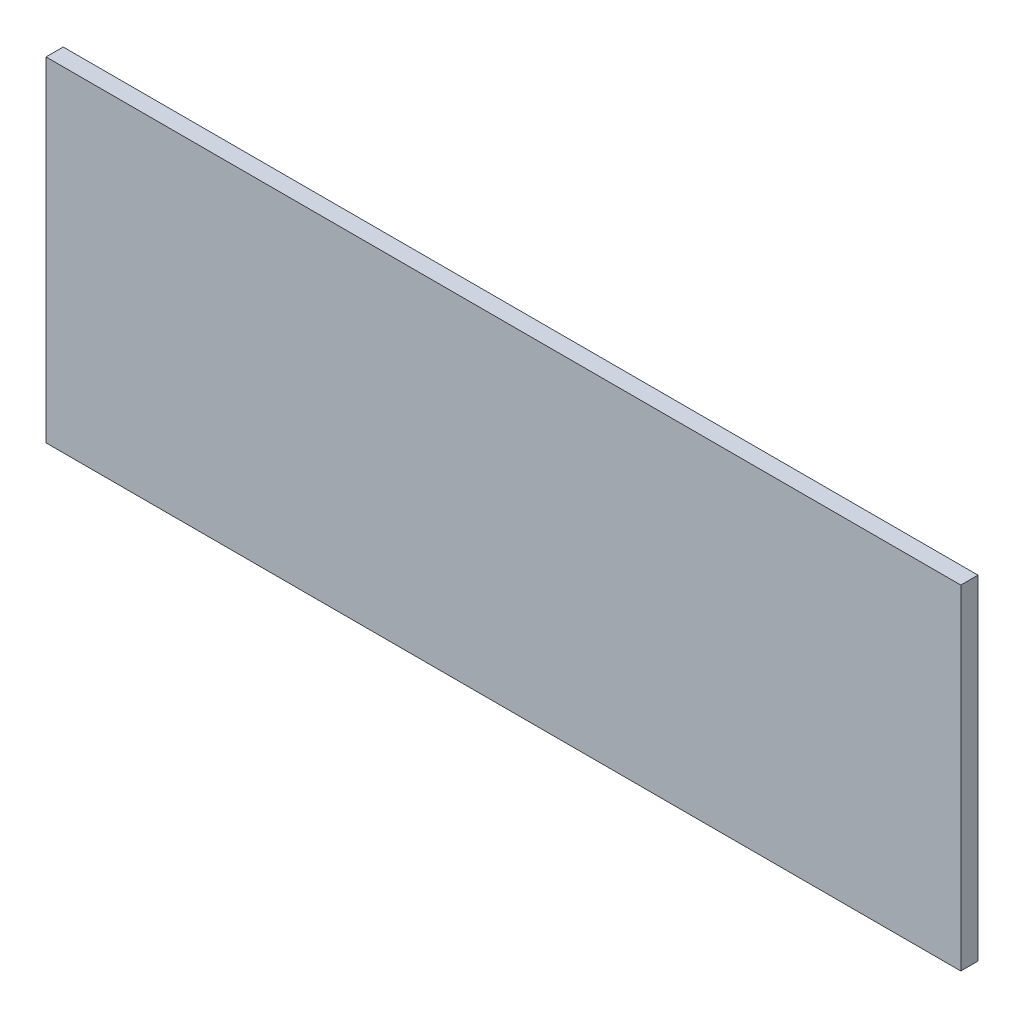
ISO-10303-21;
HEADER;
FILE_DESCRIPTION(('STEP AP214'),'2;1');
FILE_NAME('part.step','',(''),(''),'','','');
FILE_SCHEMA(('AUTOMOTIVE_DESIGN { 1 0 10303 214 1 1 1 1 }'));
ENDSEC;
DATA;
#1=APPLICATION_CONTEXT('core data for automotive mechanical design processes');
#2=APPLICATION_PROTOCOL_DEFINITION('international standard','automotive_design',2000,#1);
#3=PRODUCT_CONTEXT('',#1,'mechanical');
#4=PRODUCT('Part','Part','',(#3));
#5=PRODUCT_RELATED_PRODUCT_CATEGORY('part','',(#4));
#6=PRODUCT_DEFINITION_FORMATION('','',#4);
#7=PRODUCT_DEFINITION_CONTEXT('part definition',#1,'design');
#8=PRODUCT_DEFINITION('design','',#6,#7);
#9=PRODUCT_DEFINITION_SHAPE('','',#8);
#10=(LENGTH_UNIT() NAMED_UNIT(*) SI_UNIT(.MILLI.,.METRE.));
#11=(NAMED_UNIT(*) PLANE_ANGLE_UNIT() SI_UNIT($,.RADIAN.));
#12=(NAMED_UNIT(*) SI_UNIT($,.STERADIAN.) SOLID_ANGLE_UNIT());
#13=UNCERTAINTY_MEASURE_WITH_UNIT(LENGTH_MEASURE(1.E-05),#10,'distance_accuracy_value','');
#14=(GEOMETRIC_REPRESENTATION_CONTEXT(3) GLOBAL_UNCERTAINTY_ASSIGNED_CONTEXT((#13)) GLOBAL_UNIT_ASSIGNED_CONTEXT((#10,
#11,#12)) REPRESENTATION_CONTEXT('',''));
#15=CARTESIAN_POINT('',(0.,0.,0.));
#16=DIRECTION('',(0.,0.,1.));
#17=DIRECTION('',(1.,0.,0.));
#18=AXIS2_PLACEMENT_3D('',#15,#16,#17);
#19=CARTESIAN_POINT('',(0.,0.,5.));
#20=DIRECTION('',(1.,0.,0.));
#21=DIRECTION('',(0.,1.,0.));
#22=AXIS2_PLACEMENT_3D('',#19,#20,#21);
#23=PLANE('',#22);
#24=DIRECTION('',(0.,-1.,0.));
#25=VECTOR('',#24,1.);
#26=CARTESIAN_POINT('',(0.,0.,0.));
#27=LINE('',#26,#25);
#28=CARTESIAN_POINT('',(0.,0.,0.));
#29=VERTEX_POINT('',#28);
#30=CARTESIAN_POINT('',(1.11022302462516E-13,-97.1922331472609,0.));
#31=VERTEX_POINT('',#30);
#32=EDGE_CURVE('E96',#29,#31,#27,.T.);
#33=ORIENTED_EDGE('',*,*,#32,.T.);
#34=DIRECTION('',(0.,0.,-1.));
#35=VECTOR('',#34,1.);
#36=CARTESIAN_POINT('',(1.11022302462516E-13,-97.1922331472609,5.));
#37=LINE('',#36,#35);
#38=CARTESIAN_POINT('',(1.11022302462516E-13,-97.1922331472609,5.));
#39=VERTEX_POINT('',#38);
#40=EDGE_CURVE('E11',#39,#31,#37,.T.);
#41=ORIENTED_EDGE('',*,*,#40,.F.);
#42=DIRECTION('',(0.,-1.,0.));
#43=VECTOR('',#42,1.);
#44=CARTESIAN_POINT('',(0.,0.,5.));
#45=LINE('',#44,#43);
#46=CARTESIAN_POINT('',(0.,0.,5.));
#47=VERTEX_POINT('',#46);
#48=EDGE_CURVE('E84',#47,#39,#45,.T.);
#49=ORIENTED_EDGE('',*,*,#48,.F.);
#50=DIRECTION('',(0.,0.,-1.));
#51=VECTOR('',#50,1.);
#52=CARTESIAN_POINT('',(0.,0.,5.));
#53=LINE('',#52,#51);
#54=EDGE_CURVE('E92',#47,#29,#53,.T.);
#55=ORIENTED_EDGE('',*,*,#54,.T.);
#56=EDGE_LOOP('',(#33,#41,#49,#55));
#57=FACE_BOUND('',#56,.T.);
#58=ADVANCED_FACE('F33',(#57),#23,.F.);
#59=CARTESIAN_POINT('',(1.11022302462516E-13,-97.1922331472609,5.));
#60=DIRECTION('',(0.,1.,0.));
#61=DIRECTION('',(-1.,0.,0.));
#62=AXIS2_PLACEMENT_3D('',#59,#60,#61);
#63=PLANE('',#62);
#64=DIRECTION('',(1.,0.,0.));
#65=VECTOR('',#64,1.);
#66=CARTESIAN_POINT('',(1.11022302462516E-13,-97.1922331472609,0.));
#67=LINE('',#66,#65);
#68=CARTESIAN_POINT('',(266.,-97.1922331472609,0.));
#69=VERTEX_POINT('',#68);
#70=EDGE_CURVE('E88',#31,#69,#67,.T.);
#71=ORIENTED_EDGE('',*,*,#70,.T.);
#72=DIRECTION('',(0.,0.,-1.));
#73=VECTOR('',#72,1.);
#74=CARTESIAN_POINT('',(266.,-97.1922331472609,5.));
#75=LINE('',#74,#73);
#76=CARTESIAN_POINT('',(266.,-97.1922331472609,5.));
#77=VERTEX_POINT('',#76);
#78=EDGE_CURVE('E41',#77,#69,#75,.T.);
#79=ORIENTED_EDGE('',*,*,#78,.F.);
#80=DIRECTION('',(1.,0.,0.));
#81=VECTOR('',#80,1.);
#82=CARTESIAN_POINT('',(1.11022302462516E-13,-97.1922331472609,5.));
#83=LINE('',#82,#81);
#84=EDGE_CURVE('E79',#39,#77,#83,.T.);
#85=ORIENTED_EDGE('',*,*,#84,.F.);
#86=ORIENTED_EDGE('',*,*,#40,.T.);
#87=EDGE_LOOP('',(#71,#79,#85,#86));
#88=FACE_BOUND('',#87,.T.);
#89=ADVANCED_FACE('F87',(#88),#63,.F.);
#90=CARTESIAN_POINT('',(266.,0.,5.));
#91=DIRECTION('',(-1.,0.,0.));
#92=DIRECTION('',(0.,0.,1.));
#93=AXIS2_PLACEMENT_3D('',#90,#91,#92);
#94=PLANE('',#93);
#95=DIRECTION('',(0.,1.,0.));
#96=VECTOR('',#95,1.);
#97=CARTESIAN_POINT('',(266.,0.,0.));
#98=LINE('',#97,#96);
#99=CARTESIAN_POINT('',(266.,0.,0.));
#100=VERTEX_POINT('',#99);
#101=EDGE_CURVE('E66',#69,#100,#98,.T.);
#102=ORIENTED_EDGE('',*,*,#101,.T.);
#103=DIRECTION('',(0.,0.,-1.));
#104=VECTOR('',#103,1.);
#105=CARTESIAN_POINT('',(266.,0.,5.));
#106=LINE('',#105,#104);
#107=CARTESIAN_POINT('',(266.,0.,5.));
#108=VERTEX_POINT('',#107);
#109=EDGE_CURVE('E89',#108,#100,#106,.T.);
#110=ORIENTED_EDGE('',*,*,#109,.F.);
#111=DIRECTION('',(0.,1.,0.));
#112=VECTOR('',#111,1.);
#113=CARTESIAN_POINT('',(266.,0.,5.));
#114=LINE('',#113,#112);
#115=EDGE_CURVE('E82',#77,#108,#114,.T.);
#116=ORIENTED_EDGE('',*,*,#115,.F.);
#117=ORIENTED_EDGE('',*,*,#78,.T.);
#118=EDGE_LOOP('',(#102,#110,#116,#117));
#119=FACE_BOUND('',#118,.T.);
#120=ADVANCED_FACE('F90',(#119),#94,.F.);
#121=CARTESIAN_POINT('',(0.,0.,5.));
#122=DIRECTION('',(0.,-1.,0.));
#123=DIRECTION('',(1.,0.,0.));
#124=AXIS2_PLACEMENT_3D('',#121,#122,#123);
#125=PLANE('',#124);
#126=DIRECTION('',(-1.,0.,0.));
#127=VECTOR('',#126,1.);
#128=CARTESIAN_POINT('',(0.,0.,0.));
#129=LINE('',#128,#127);
#130=EDGE_CURVE('E72',#100,#29,#129,.T.);
#131=ORIENTED_EDGE('',*,*,#130,.T.);
#132=ORIENTED_EDGE('',*,*,#54,.F.);
#133=DIRECTION('',(-1.,0.,0.));
#134=VECTOR('',#133,1.);
#135=CARTESIAN_POINT('',(0.,0.,5.));
#136=LINE('',#135,#134);
#137=EDGE_CURVE('E49',#108,#47,#136,.T.);
#138=ORIENTED_EDGE('',*,*,#137,.F.);
#139=ORIENTED_EDGE('',*,*,#109,.T.);
#140=EDGE_LOOP('',(#131,#132,#138,#139));
#141=FACE_BOUND('',#140,.T.);
#142=ADVANCED_FACE('F103',(#141),#125,.F.);
#143=CARTESIAN_POINT('',(0.,0.,5.));
#144=DIRECTION('',(0.,0.,1.));
#145=DIRECTION('',(1.,0.,0.));
#146=AXIS2_PLACEMENT_3D('',#143,#144,#145);
#147=PLANE('',#146);
#148=ORIENTED_EDGE('',*,*,#48,.T.);
#149=ORIENTED_EDGE('',*,*,#84,.T.);
#150=ORIENTED_EDGE('',*,*,#115,.T.);
#151=ORIENTED_EDGE('',*,*,#137,.T.);
#152=EDGE_LOOP('',(#148,#149,#150,#151));
#153=FACE_BOUND('',#152,.T.);
#154=ADVANCED_FACE('F80',(#153),#147,.T.);
#155=CARTESIAN_POINT('',(0.,0.,0.));
#156=DIRECTION('',(0.,0.,1.));
#157=DIRECTION('',(1.,0.,0.));
#158=AXIS2_PLACEMENT_3D('',#155,#156,#157);
#159=PLANE('',#158);
#160=ORIENTED_EDGE('',*,*,#32,.F.);
#161=ORIENTED_EDGE('',*,*,#130,.F.);
#162=ORIENTED_EDGE('',*,*,#101,.F.);
#163=ORIENTED_EDGE('',*,*,#70,.F.);
#164=EDGE_LOOP('',(#160,#161,#162,#163));
#165=FACE_BOUND('',#164,.T.);
#166=ADVANCED_FACE('F106',(#165),#159,.F.);
#167=CLOSED_SHELL('',(#58,#89,#120,#142,#154,#166));
#168=MANIFOLD_SOLID_BREP('B2',#167);
#169=ADVANCED_BREP_SHAPE_REPRESENTATION('',(#18,#168),#14);
#170=SHAPE_DEFINITION_REPRESENTATION(#9,#169);
ENDSEC;
END-ISO-10303-21;
